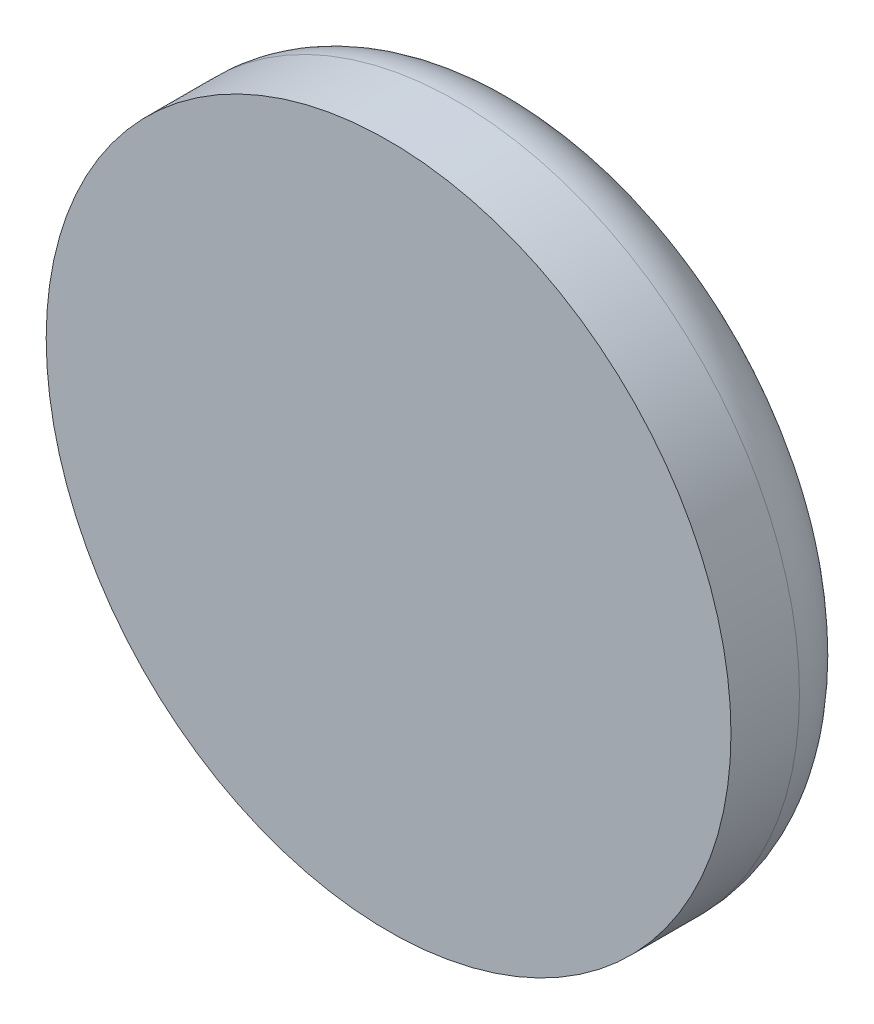
ISO-10303-21;
HEADER;
FILE_DESCRIPTION(('STEP AP214'),'2;1');
FILE_NAME('part.step','',(''),(''),'','','');
FILE_SCHEMA(('AUTOMOTIVE_DESIGN { 1 0 10303 214 1 1 1 1 }'));
ENDSEC;
DATA;
#1=APPLICATION_CONTEXT('core data for automotive mechanical design processes');
#2=APPLICATION_PROTOCOL_DEFINITION('international standard','automotive_design',2000,#1);
#3=PRODUCT_CONTEXT('',#1,'mechanical');
#4=PRODUCT('Part','Part','',(#3));
#5=PRODUCT_RELATED_PRODUCT_CATEGORY('part','',(#4));
#6=PRODUCT_DEFINITION_FORMATION('','',#4);
#7=PRODUCT_DEFINITION_CONTEXT('part definition',#1,'design');
#8=PRODUCT_DEFINITION('design','',#6,#7);
#9=PRODUCT_DEFINITION_SHAPE('','',#8);
#10=(LENGTH_UNIT() NAMED_UNIT(*) SI_UNIT(.MILLI.,.METRE.));
#11=(NAMED_UNIT(*) PLANE_ANGLE_UNIT() SI_UNIT($,.RADIAN.));
#12=(NAMED_UNIT(*) SI_UNIT($,.STERADIAN.) SOLID_ANGLE_UNIT());
#13=UNCERTAINTY_MEASURE_WITH_UNIT(LENGTH_MEASURE(1.E-05),#10,'distance_accuracy_value','');
#14=(GEOMETRIC_REPRESENTATION_CONTEXT(3) GLOBAL_UNCERTAINTY_ASSIGNED_CONTEXT((#13)) GLOBAL_UNIT_ASSIGNED_CONTEXT((#10,
#11,#12)) REPRESENTATION_CONTEXT('',''));
#15=CARTESIAN_POINT('',(0.,0.,0.));
#16=DIRECTION('',(0.,0.,1.));
#17=DIRECTION('',(1.,0.,0.));
#18=AXIS2_PLACEMENT_3D('',#15,#16,#17);
#19=CARTESIAN_POINT('',(0.,15.1529920849089,-6.34669812241938));
#20=DIRECTION('',(0.,0.,1.));
#21=DIRECTION('',(1.,0.,0.));
#22=AXIS2_PLACEMENT_3D('',#19,#20,#21);
#23=CYLINDRICAL_SURFACE('',#22,1.);
#24=CARTESIAN_POINT('',(0.,15.1529920849089,-4.94669812241938));
#25=DIRECTION('',(0.,0.,1.));
#26=DIRECTION('',(1.,0.,0.));
#27=AXIS2_PLACEMENT_3D('',#24,#25,#26);
#28=CIRCLE('',#27,1.);
#29=CARTESIAN_POINT('',(1.,15.1529920849089,-4.94669812241938));
#30=VERTEX_POINT('',#29);
#31=EDGE_CURVE('E10',#30,#30,#28,.T.);
#32=ORIENTED_EDGE('',*,*,#31,.T.);
#33=EDGE_LOOP('',(#32));
#34=FACE_BOUND('',#33,.T.);
#35=CARTESIAN_POINT('',(0.,15.1529920849089,-6.34669812241938));
#36=DIRECTION('',(0.,0.,1.));
#37=DIRECTION('',(1.,0.,0.));
#38=AXIS2_PLACEMENT_3D('',#35,#36,#37);
#39=CIRCLE('',#38,1.);
#40=CARTESIAN_POINT('',(1.,15.1529920849089,-6.34669812241938));
#41=VERTEX_POINT('',#40);
#42=EDGE_CURVE('E66',#41,#41,#39,.T.);
#43=ORIENTED_EDGE('',*,*,#42,.F.);
#44=EDGE_LOOP('',(#43));
#45=FACE_BOUND('',#44,.T.);
#46=ADVANCED_FACE('F43',(#34,#45),#23,.F.);
#47=CARTESIAN_POINT('',(1.,15.1529920849089,-4.94669812241938));
#48=DIRECTION('',(0.,0.,-1.));
#49=DIRECTION('',(-1.,0.,0.));
#50=AXIS2_PLACEMENT_3D('',#47,#48,#49);
#51=PLANE('',#50);
#52=ORIENTED_EDGE('',*,*,#31,.F.);
#53=EDGE_LOOP('',(#52));
#54=FACE_BOUND('',#53,.T.);
#55=ADVANCED_FACE('F75',(#54),#51,.T.);
#56=CARTESIAN_POINT('',(0.,15.1529920849089,-4.34669812241938));
#57=DIRECTION('',(0.,0.,1.));
#58=DIRECTION('',(1.,0.,0.));
#59=AXIS2_PLACEMENT_3D('',#56,#57,#58);
#60=PLANE('',#59);
#61=CARTESIAN_POINT('',(0.,15.1529920849089,-4.34669812241938));
#62=DIRECTION('',(0.,0.,1.));
#63=DIRECTION('',(1.,0.,0.));
#64=AXIS2_PLACEMENT_3D('',#61,#62,#63);
#65=CIRCLE('',#64,5.);
#66=CARTESIAN_POINT('',(5.,15.1529920849089,-4.34669812241938));
#67=VERTEX_POINT('',#66);
#68=EDGE_CURVE('E50',#67,#67,#65,.T.);
#69=ORIENTED_EDGE('',*,*,#68,.T.);
#70=EDGE_LOOP('',(#69));
#71=FACE_BOUND('',#70,.T.);
#72=ADVANCED_FACE('F79',(#71),#60,.T.);
#73=CARTESIAN_POINT('',(0.,15.1529920849089,-6.34669812241938));
#74=DIRECTION('',(0.,0.,1.));
#75=DIRECTION('',(1.,0.,0.));
#76=AXIS2_PLACEMENT_3D('',#73,#74,#75);
#77=CYLINDRICAL_SURFACE('',#76,5.);
#78=CARTESIAN_POINT('',(0.,15.1529920849089,-5.34669812241938));
#79=DIRECTION('',(0.,0.,1.));
#80=DIRECTION('',(1.,0.,0.));
#81=AXIS2_PLACEMENT_3D('',#78,#79,#80);
#82=CIRCLE('',#81,5.);
#83=CARTESIAN_POINT('',(5.,15.1529920849089,-5.34669812241938));
#84=VERTEX_POINT('',#83);
#85=EDGE_CURVE('E55',#84,#84,#82,.T.);
#86=ORIENTED_EDGE('',*,*,#85,.T.);
#87=EDGE_LOOP('',(#86));
#88=FACE_BOUND('',#87,.T.);
#89=ORIENTED_EDGE('',*,*,#68,.F.);
#90=EDGE_LOOP('',(#89));
#91=FACE_BOUND('',#90,.T.);
#92=ADVANCED_FACE('F84',(#88,#91),#77,.T.);
#93=CARTESIAN_POINT('',(0.,15.1529920849089,-5.34669812241938));
#94=DIRECTION('',(0.,0.,1.));
#95=DIRECTION('',(1.,0.,0.));
#96=AXIS2_PLACEMENT_3D('',#93,#94,#95);
#97=TOROIDAL_SURFACE('',#96,4.,1.);
#98=CARTESIAN_POINT('',(0.,15.1529920849089,-6.34669812241938));
#99=DIRECTION('',(0.,0.,1.));
#100=DIRECTION('',(1.,0.,0.));
#101=AXIS2_PLACEMENT_3D('',#98,#99,#100);
#102=CIRCLE('',#101,4.);
#103=CARTESIAN_POINT('',(4.,15.1529920849089,-6.34669812241938));
#104=VERTEX_POINT('',#103);
#105=EDGE_CURVE('E60',#104,#104,#102,.T.);
#106=ORIENTED_EDGE('',*,*,#105,.T.);
#107=EDGE_LOOP('',(#106));
#108=FACE_BOUND('',#107,.T.);
#109=ORIENTED_EDGE('',*,*,#85,.F.);
#110=EDGE_LOOP('',(#109));
#111=FACE_BOUND('',#110,.T.);
#112=ADVANCED_FACE('F89',(#108,#111),#97,.T.);
#113=CARTESIAN_POINT('',(4.,15.1529920849089,-6.34669812241938));
#114=DIRECTION('',(0.,0.,-1.));
#115=DIRECTION('',(-1.,0.,0.));
#116=AXIS2_PLACEMENT_3D('',#113,#114,#115);
#117=PLANE('',#116);
#118=ORIENTED_EDGE('',*,*,#42,.T.);
#119=EDGE_LOOP('',(#118));
#120=FACE_BOUND('',#119,.T.);
#121=ORIENTED_EDGE('',*,*,#105,.F.);
#122=EDGE_LOOP('',(#121));
#123=FACE_BOUND('',#122,.T.);
#124=ADVANCED_FACE('F71',(#120,#123),#117,.T.);
#125=CLOSED_SHELL('',(#46,#55,#72,#92,#112,#124));
#126=MANIFOLD_SOLID_BREP('B2',#125);
#127=ADVANCED_BREP_SHAPE_REPRESENTATION('',(#18,#126),#14);
#128=SHAPE_DEFINITION_REPRESENTATION(#9,#127);
ENDSEC;
END-ISO-10303-21;
